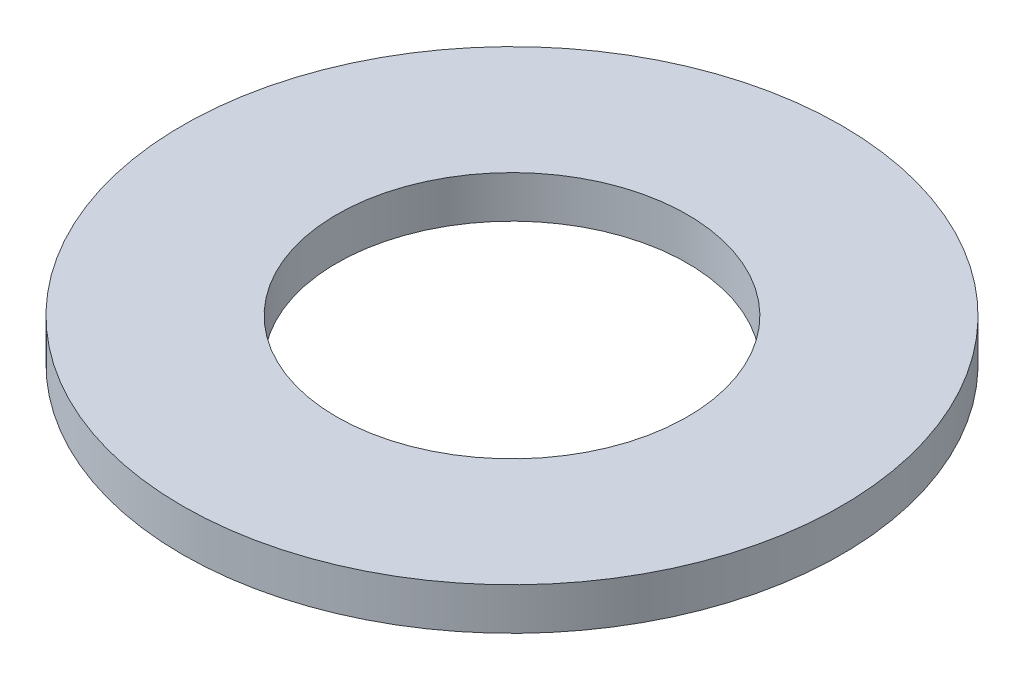
ISO-10303-21;
HEADER;
FILE_DESCRIPTION(('STEP AP214'),'2;1');
FILE_NAME('part.step','',(''),(''),'','','');
FILE_SCHEMA(('AUTOMOTIVE_DESIGN { 1 0 10303 214 1 1 1 1 }'));
ENDSEC;
DATA;
#1=APPLICATION_CONTEXT('core data for automotive mechanical design processes');
#2=APPLICATION_PROTOCOL_DEFINITION('international standard','automotive_design',2000,#1);
#3=PRODUCT_CONTEXT('',#1,'mechanical');
#4=PRODUCT('Part','Part','',(#3));
#5=PRODUCT_RELATED_PRODUCT_CATEGORY('part','',(#4));
#6=PRODUCT_DEFINITION_FORMATION('','',#4);
#7=PRODUCT_DEFINITION_CONTEXT('part definition',#1,'design');
#8=PRODUCT_DEFINITION('design','',#6,#7);
#9=PRODUCT_DEFINITION_SHAPE('','',#8);
#10=(LENGTH_UNIT() NAMED_UNIT(*) SI_UNIT(.MILLI.,.METRE.));
#11=(NAMED_UNIT(*) PLANE_ANGLE_UNIT() SI_UNIT($,.RADIAN.));
#12=(NAMED_UNIT(*) SI_UNIT($,.STERADIAN.) SOLID_ANGLE_UNIT());
#13=UNCERTAINTY_MEASURE_WITH_UNIT(LENGTH_MEASURE(1.E-05),#10,'distance_accuracy_value','');
#14=(GEOMETRIC_REPRESENTATION_CONTEXT(3) GLOBAL_UNCERTAINTY_ASSIGNED_CONTEXT((#13)) GLOBAL_UNIT_ASSIGNED_CONTEXT((#10,
#11,#12)) REPRESENTATION_CONTEXT('',''));
#15=CARTESIAN_POINT('',(0.,0.,0.));
#16=DIRECTION('',(0.,0.,1.));
#17=DIRECTION('',(1.,0.,0.));
#18=AXIS2_PLACEMENT_3D('',#15,#16,#17);
#19=CARTESIAN_POINT('',(0.,0.762,0.));
#20=DIRECTION('',(0.,1.,0.));
#21=DIRECTION('',(0.,0.,1.));
#22=AXIS2_PLACEMENT_3D('',#19,#20,#21);
#23=PLANE('',#22);
#24=CARTESIAN_POINT('',(0.,0.762,0.));
#25=DIRECTION('',(0.,1.,0.));
#26=DIRECTION('',(0.,0.,1.));
#27=AXIS2_PLACEMENT_3D('',#24,#25,#26);
#28=CIRCLE('',#27,5.969);
#29=CARTESIAN_POINT('',(0.,0.762,5.969));
#30=VERTEX_POINT('',#29);
#31=EDGE_CURVE('E10',#30,#30,#28,.T.);
#32=ORIENTED_EDGE('',*,*,#31,.T.);
#33=EDGE_LOOP('',(#32));
#34=FACE_BOUND('',#33,.T.);
#35=CARTESIAN_POINT('',(0.,0.762,0.));
#36=DIRECTION('',(0.,1.,0.));
#37=DIRECTION('',(0.,0.,1.));
#38=AXIS2_PLACEMENT_3D('',#35,#36,#37);
#39=CIRCLE('',#38,3.175);
#40=CARTESIAN_POINT('',(0.,0.762,3.175));
#41=VERTEX_POINT('',#40);
#42=EDGE_CURVE('E41',#41,#41,#39,.T.);
#43=ORIENTED_EDGE('',*,*,#42,.F.);
#44=EDGE_LOOP('',(#43));
#45=FACE_BOUND('',#44,.T.);
#46=ADVANCED_FACE('F30',(#34,#45),#23,.T.);
#47=CARTESIAN_POINT('',(0.,0.,0.));
#48=DIRECTION('',(0.,1.,0.));
#49=DIRECTION('',(0.,0.,1.));
#50=AXIS2_PLACEMENT_3D('',#47,#48,#49);
#51=PLANE('',#50);
#52=CARTESIAN_POINT('',(0.,0.,0.));
#53=DIRECTION('',(0.,1.,0.));
#54=DIRECTION('',(0.,0.,1.));
#55=AXIS2_PLACEMENT_3D('',#52,#53,#54);
#56=CIRCLE('',#55,5.969);
#57=CARTESIAN_POINT('',(0.,0.,5.969));
#58=VERTEX_POINT('',#57);
#59=EDGE_CURVE('E34',#58,#58,#56,.T.);
#60=ORIENTED_EDGE('',*,*,#59,.F.);
#61=EDGE_LOOP('',(#60));
#62=FACE_BOUND('',#61,.T.);
#63=CARTESIAN_POINT('',(0.,0.,0.));
#64=DIRECTION('',(0.,1.,0.));
#65=DIRECTION('',(0.,0.,1.));
#66=AXIS2_PLACEMENT_3D('',#63,#64,#65);
#67=CIRCLE('',#66,3.175);
#68=CARTESIAN_POINT('',(0.,0.,3.175));
#69=VERTEX_POINT('',#68);
#70=EDGE_CURVE('E43',#69,#69,#67,.T.);
#71=ORIENTED_EDGE('',*,*,#70,.T.);
#72=EDGE_LOOP('',(#71));
#73=FACE_BOUND('',#72,.T.);
#74=ADVANCED_FACE('F53',(#62,#73),#51,.F.);
#75=CARTESIAN_POINT('',(0.,0.762,0.));
#76=DIRECTION('',(0.,-1.,0.));
#77=DIRECTION('',(0.,0.,-1.));
#78=AXIS2_PLACEMENT_3D('',#75,#76,#77);
#79=CYLINDRICAL_SURFACE('',#78,5.969);
#80=ORIENTED_EDGE('',*,*,#31,.F.);
#81=EDGE_LOOP('',(#80));
#82=FACE_BOUND('',#81,.T.);
#83=ORIENTED_EDGE('',*,*,#59,.T.);
#84=EDGE_LOOP('',(#83));
#85=FACE_BOUND('',#84,.T.);
#86=ADVANCED_FACE('F32',(#82,#85),#79,.T.);
#87=CARTESIAN_POINT('',(0.,0.762,0.));
#88=DIRECTION('',(0.,-1.,0.));
#89=DIRECTION('',(0.,0.,-1.));
#90=AXIS2_PLACEMENT_3D('',#87,#88,#89);
#91=CYLINDRICAL_SURFACE('',#90,3.175);
#92=ORIENTED_EDGE('',*,*,#42,.T.);
#93=EDGE_LOOP('',(#92));
#94=FACE_BOUND('',#93,.T.);
#95=ORIENTED_EDGE('',*,*,#70,.F.);
#96=EDGE_LOOP('',(#95));
#97=FACE_BOUND('',#96,.T.);
#98=ADVANCED_FACE('F49',(#94,#97),#91,.F.);
#99=CLOSED_SHELL('',(#46,#74,#86,#98));
#100=MANIFOLD_SOLID_BREP('B2',#99);
#101=ADVANCED_BREP_SHAPE_REPRESENTATION('',(#18,#100),#14);
#102=SHAPE_DEFINITION_REPRESENTATION(#9,#101);
ENDSEC;
END-ISO-10303-21;
